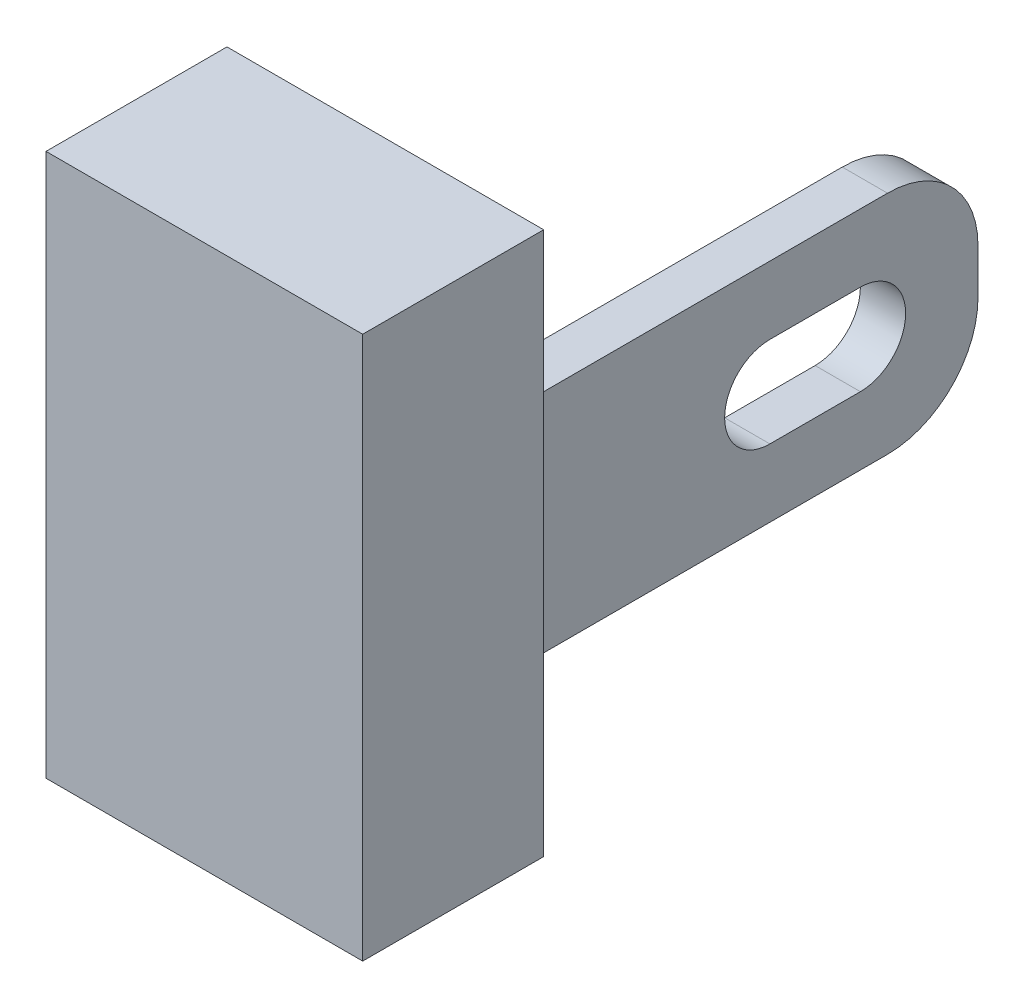
ISO-10303-21;
HEADER;
FILE_DESCRIPTION(('STEP AP214'),'2;1');
FILE_NAME('part.step','',(''),(''),'','','');
FILE_SCHEMA(('AUTOMOTIVE_DESIGN { 1 0 10303 214 1 1 1 1 }'));
ENDSEC;
DATA;
#1=APPLICATION_CONTEXT('core data for automotive mechanical design processes');
#2=APPLICATION_PROTOCOL_DEFINITION('international standard','automotive_design',2000,#1);
#3=PRODUCT_CONTEXT('',#1,'mechanical');
#4=PRODUCT('Part','Part','',(#3));
#5=PRODUCT_RELATED_PRODUCT_CATEGORY('part','',(#4));
#6=PRODUCT_DEFINITION_FORMATION('','',#4);
#7=PRODUCT_DEFINITION_CONTEXT('part definition',#1,'design');
#8=PRODUCT_DEFINITION('design','',#6,#7);
#9=PRODUCT_DEFINITION_SHAPE('','',#8);
#10=(LENGTH_UNIT() NAMED_UNIT(*) SI_UNIT(.MILLI.,.METRE.));
#11=(NAMED_UNIT(*) PLANE_ANGLE_UNIT() SI_UNIT($,.RADIAN.));
#12=(NAMED_UNIT(*) SI_UNIT($,.STERADIAN.) SOLID_ANGLE_UNIT());
#13=UNCERTAINTY_MEASURE_WITH_UNIT(LENGTH_MEASURE(1.E-05),#10,'distance_accuracy_value','');
#14=(GEOMETRIC_REPRESENTATION_CONTEXT(3) GLOBAL_UNCERTAINTY_ASSIGNED_CONTEXT((#13)) GLOBAL_UNIT_ASSIGNED_CONTEXT((#10,
#11,#12)) REPRESENTATION_CONTEXT('',''));
#15=CARTESIAN_POINT('',(0.,0.,0.));
#16=DIRECTION('',(0.,0.,1.));
#17=DIRECTION('',(1.,0.,0.));
#18=AXIS2_PLACEMENT_3D('',#15,#16,#17);
#19=CARTESIAN_POINT('',(0.,0.,0.));
#20=DIRECTION('',(0.,0.,1.));
#21=DIRECTION('',(1.,0.,0.));
#22=AXIS2_PLACEMENT_3D('',#19,#20,#21);
#23=PLANE('',#22);
#24=DIRECTION('',(0.,-1.,0.));
#25=VECTOR('',#24,1.);
#26=CARTESIAN_POINT('',(-1.75,-3.,0.));
#27=LINE('',#26,#25);
#28=CARTESIAN_POINT('',(-1.75,3.,0.));
#29=VERTEX_POINT('',#28);
#30=CARTESIAN_POINT('',(-1.75,-3.,0.));
#31=VERTEX_POINT('',#30);
#32=EDGE_CURVE('E206',#29,#31,#27,.T.);
#33=ORIENTED_EDGE('',*,*,#32,.F.);
#34=DIRECTION('',(-1.,0.,0.));
#35=VECTOR('',#34,1.);
#36=CARTESIAN_POINT('',(1.75,3.,0.));
#37=LINE('',#36,#35);
#38=CARTESIAN_POINT('',(1.75,3.,0.));
#39=VERTEX_POINT('',#38);
#40=EDGE_CURVE('E211',#39,#29,#37,.T.);
#41=ORIENTED_EDGE('',*,*,#40,.F.);
#42=DIRECTION('',(0.,1.,0.));
#43=VECTOR('',#42,1.);
#44=CARTESIAN_POINT('',(1.75,-3.,0.));
#45=LINE('',#44,#43);
#46=CARTESIAN_POINT('',(1.75,-3.,0.));
#47=VERTEX_POINT('',#46);
#48=EDGE_CURVE('E222',#47,#39,#45,.T.);
#49=ORIENTED_EDGE('',*,*,#48,.F.);
#50=DIRECTION('',(1.,0.,0.));
#51=VECTOR('',#50,1.);
#52=CARTESIAN_POINT('',(1.75,-3.,0.));
#53=LINE('',#52,#51);
#54=EDGE_CURVE('E220',#31,#47,#53,.T.);
#55=ORIENTED_EDGE('',*,*,#54,.F.);
#56=EDGE_LOOP('',(#33,#41,#49,#55));
#57=FACE_BOUND('',#56,.T.);
#58=DIRECTION('',(0.,1.,0.));
#59=VECTOR('',#58,1.);
#60=CARTESIAN_POINT('',(1.05,-1.25,0.));
#61=LINE('',#60,#59);
#62=CARTESIAN_POINT('',(1.05,-1.25,0.));
#63=VERTEX_POINT('',#62);
#64=CARTESIAN_POINT('',(1.05,1.25,0.));
#65=VERTEX_POINT('',#64);
#66=EDGE_CURVE('E180',#63,#65,#61,.T.);
#67=ORIENTED_EDGE('',*,*,#66,.F.);
#68=DIRECTION('',(-1.,0.,0.));
#69=VECTOR('',#68,1.);
#70=CARTESIAN_POINT('',(1.55,-1.25,0.));
#71=LINE('',#70,#69);
#72=CARTESIAN_POINT('',(1.55,-1.25,0.));
#73=VERTEX_POINT('',#72);
#74=EDGE_CURVE('E185',#73,#63,#71,.T.);
#75=ORIENTED_EDGE('',*,*,#74,.F.);
#76=DIRECTION('',(0.,-1.,0.));
#77=VECTOR('',#76,1.);
#78=CARTESIAN_POINT('',(1.55,-1.25,0.));
#79=LINE('',#78,#77);
#80=CARTESIAN_POINT('',(1.55,1.25,0.));
#81=VERTEX_POINT('',#80);
#82=EDGE_CURVE('E194',#81,#73,#79,.T.);
#83=ORIENTED_EDGE('',*,*,#82,.F.);
#84=DIRECTION('',(1.,0.,0.));
#85=VECTOR('',#84,1.);
#86=CARTESIAN_POINT('',(1.55,1.25,0.));
#87=LINE('',#86,#85);
#88=EDGE_CURVE('E191',#65,#81,#87,.T.);
#89=ORIENTED_EDGE('',*,*,#88,.F.);
#90=EDGE_LOOP('',(#67,#75,#83,#89));
#91=FACE_BOUND('',#90,.T.);
#92=ADVANCED_FACE('F43',(#57,#91),#23,.F.);
#93=CARTESIAN_POINT('',(-1.75,-3.,2.));
#94=DIRECTION('',(1.,0.,0.));
#95=DIRECTION('',(0.,0.,-1.));
#96=AXIS2_PLACEMENT_3D('',#93,#94,#95);
#97=PLANE('',#96);
#98=ORIENTED_EDGE('',*,*,#32,.T.);
#99=DIRECTION('',(0.,0.,-1.));
#100=VECTOR('',#99,1.);
#101=CARTESIAN_POINT('',(-1.75,-3.,2.));
#102=LINE('',#101,#100);
#103=CARTESIAN_POINT('',(-1.75,-3.,2.));
#104=VERTEX_POINT('',#103);
#105=EDGE_CURVE('E233',#104,#31,#102,.T.);
#106=ORIENTED_EDGE('',*,*,#105,.F.);
#107=DIRECTION('',(0.,-1.,0.));
#108=VECTOR('',#107,1.);
#109=CARTESIAN_POINT('',(-1.75,-3.,2.));
#110=LINE('',#109,#108);
#111=CARTESIAN_POINT('',(-1.75,3.,2.));
#112=VERTEX_POINT('',#111);
#113=EDGE_CURVE('E207',#112,#104,#110,.T.);
#114=ORIENTED_EDGE('',*,*,#113,.F.);
#115=DIRECTION('',(0.,0.,-1.));
#116=VECTOR('',#115,1.);
#117=CARTESIAN_POINT('',(-1.75,3.,2.));
#118=LINE('',#117,#116);
#119=EDGE_CURVE('E217',#112,#29,#118,.T.);
#120=ORIENTED_EDGE('',*,*,#119,.T.);
#121=EDGE_LOOP('',(#98,#106,#114,#120));
#122=FACE_BOUND('',#121,.T.);
#123=ADVANCED_FACE('F287',(#122),#97,.F.);
#124=CARTESIAN_POINT('',(1.75,-3.,2.));
#125=DIRECTION('',(0.,1.,0.));
#126=DIRECTION('',(0.,0.,1.));
#127=AXIS2_PLACEMENT_3D('',#124,#125,#126);
#128=PLANE('',#127);
#129=ORIENTED_EDGE('',*,*,#54,.T.);
#130=DIRECTION('',(0.,0.,-1.));
#131=VECTOR('',#130,1.);
#132=CARTESIAN_POINT('',(1.75,-3.,2.));
#133=LINE('',#132,#131);
#134=CARTESIAN_POINT('',(1.75,-3.,2.));
#135=VERTEX_POINT('',#134);
#136=EDGE_CURVE('E230',#135,#47,#133,.T.);
#137=ORIENTED_EDGE('',*,*,#136,.F.);
#138=DIRECTION('',(1.,0.,0.));
#139=VECTOR('',#138,1.);
#140=CARTESIAN_POINT('',(1.75,-3.,2.));
#141=LINE('',#140,#139);
#142=EDGE_CURVE('E210',#104,#135,#141,.T.);
#143=ORIENTED_EDGE('',*,*,#142,.F.);
#144=ORIENTED_EDGE('',*,*,#105,.T.);
#145=EDGE_LOOP('',(#129,#137,#143,#144));
#146=FACE_BOUND('',#145,.T.);
#147=ADVANCED_FACE('F293',(#146),#128,.F.);
#148=CARTESIAN_POINT('',(1.75,-3.,2.));
#149=DIRECTION('',(-1.,0.,0.));
#150=DIRECTION('',(0.,0.,1.));
#151=AXIS2_PLACEMENT_3D('',#148,#149,#150);
#152=PLANE('',#151);
#153=ORIENTED_EDGE('',*,*,#48,.T.);
#154=DIRECTION('',(0.,0.,-1.));
#155=VECTOR('',#154,1.);
#156=CARTESIAN_POINT('',(1.75,3.,2.));
#157=LINE('',#156,#155);
#158=CARTESIAN_POINT('',(1.75,3.,2.));
#159=VERTEX_POINT('',#158);
#160=EDGE_CURVE('E227',#159,#39,#157,.T.);
#161=ORIENTED_EDGE('',*,*,#160,.F.);
#162=DIRECTION('',(0.,1.,0.));
#163=VECTOR('',#162,1.);
#164=CARTESIAN_POINT('',(1.75,-3.,2.));
#165=LINE('',#164,#163);
#166=EDGE_CURVE('E213',#135,#159,#165,.T.);
#167=ORIENTED_EDGE('',*,*,#166,.F.);
#168=ORIENTED_EDGE('',*,*,#136,.T.);
#169=EDGE_LOOP('',(#153,#161,#167,#168));
#170=FACE_BOUND('',#169,.T.);
#171=ADVANCED_FACE('F304',(#170),#152,.F.);
#172=CARTESIAN_POINT('',(1.75,3.,2.));
#173=DIRECTION('',(0.,-1.,0.));
#174=DIRECTION('',(0.,0.,-1.));
#175=AXIS2_PLACEMENT_3D('',#172,#173,#174);
#176=PLANE('',#175);
#177=ORIENTED_EDGE('',*,*,#40,.T.);
#178=ORIENTED_EDGE('',*,*,#119,.F.);
#179=DIRECTION('',(-1.,0.,0.));
#180=VECTOR('',#179,1.);
#181=CARTESIAN_POINT('',(1.75,3.,2.));
#182=LINE('',#181,#180);
#183=EDGE_CURVE('E215',#159,#112,#182,.T.);
#184=ORIENTED_EDGE('',*,*,#183,.F.);
#185=ORIENTED_EDGE('',*,*,#160,.T.);
#186=EDGE_LOOP('',(#177,#178,#184,#185));
#187=FACE_BOUND('',#186,.T.);
#188=ADVANCED_FACE('F301',(#187),#176,.F.);
#189=CARTESIAN_POINT('',(0.,0.,2.));
#190=DIRECTION('',(0.,0.,1.));
#191=DIRECTION('',(1.,0.,0.));
#192=AXIS2_PLACEMENT_3D('',#189,#190,#191);
#193=PLANE('',#192);
#194=ORIENTED_EDGE('',*,*,#113,.T.);
#195=ORIENTED_EDGE('',*,*,#142,.T.);
#196=ORIENTED_EDGE('',*,*,#166,.T.);
#197=ORIENTED_EDGE('',*,*,#183,.T.);
#198=EDGE_LOOP('',(#194,#195,#196,#197));
#199=FACE_BOUND('',#198,.T.);
#200=ADVANCED_FACE('F299',(#199),#193,.T.);
#201=CARTESIAN_POINT('',(1.05,-1.25,-5.));
#202=DIRECTION('',(1.,0.,0.));
#203=DIRECTION('',(0.,0.,-1.));
#204=AXIS2_PLACEMENT_3D('',#201,#202,#203);
#205=PLANE('',#204);
#206=DIRECTION('',(0.,0.,1.));
#207=VECTOR('',#206,1.);
#208=CARTESIAN_POINT('',(1.05,0.5,-5.));
#209=LINE('',#208,#207);
#210=CARTESIAN_POINT('',(1.05,0.5,-3.7));
#211=VERTEX_POINT('',#210);
#212=CARTESIAN_POINT('',(1.05,0.5,-2.7));
#213=VERTEX_POINT('',#212);
#214=EDGE_CURVE('E174',#211,#213,#209,.T.);
#215=ORIENTED_EDGE('',*,*,#214,.T.);
#216=CARTESIAN_POINT('',(1.05,0.,-2.7));
#217=DIRECTION('',(1.,0.,0.));
#218=DIRECTION('',(0.,0.,-1.));
#219=AXIS2_PLACEMENT_3D('',#216,#217,#218);
#220=CIRCLE('',#219,0.5);
#221=CARTESIAN_POINT('',(1.05,-0.5,-2.7));
#222=VERTEX_POINT('',#221);
#223=EDGE_CURVE('E177',#213,#222,#220,.T.);
#224=ORIENTED_EDGE('',*,*,#223,.T.);
#225=DIRECTION('',(0.,0.,-1.));
#226=VECTOR('',#225,1.);
#227=CARTESIAN_POINT('',(1.05,-0.5,-5.));
#228=LINE('',#227,#226);
#229=CARTESIAN_POINT('',(1.05,-0.5,-3.7));
#230=VERTEX_POINT('',#229);
#231=EDGE_CURVE('E169',#222,#230,#228,.T.);
#232=ORIENTED_EDGE('',*,*,#231,.T.);
#233=CARTESIAN_POINT('',(1.05,0.,-3.7));
#234=DIRECTION('',(1.,0.,0.));
#235=DIRECTION('',(0.,0.,-1.));
#236=AXIS2_PLACEMENT_3D('',#233,#234,#235);
#237=CIRCLE('',#236,0.5);
#238=EDGE_CURVE('E149',#230,#211,#237,.T.);
#239=ORIENTED_EDGE('',*,*,#238,.T.);
#240=EDGE_LOOP('',(#215,#224,#232,#239));
#241=FACE_BOUND('',#240,.T.);
#242=DIRECTION('',(0.,1.,0.));
#243=VECTOR('',#242,1.);
#244=CARTESIAN_POINT('',(1.05,-1.25,-5.));
#245=LINE('',#244,#243);
#246=CARTESIAN_POINT('',(1.05,-0.25,-5.));
#247=VERTEX_POINT('',#246);
#248=CARTESIAN_POINT('',(1.05,0.25,-5.));
#249=VERTEX_POINT('',#248);
#250=EDGE_CURVE('E181',#247,#249,#245,.T.);
#251=ORIENTED_EDGE('',*,*,#250,.F.);
#252=CARTESIAN_POINT('',(1.05,-0.25,-4.));
#253=DIRECTION('',(1.,0.,0.));
#254=DIRECTION('',(0.,0.,-1.));
#255=AXIS2_PLACEMENT_3D('',#252,#253,#254);
#256=CIRCLE('',#255,1.);
#257=CARTESIAN_POINT('',(1.05,-1.25,-4.));
#258=VERTEX_POINT('',#257);
#259=EDGE_CURVE('E244',#247,#258,#256,.F.);
#260=ORIENTED_EDGE('',*,*,#259,.T.);
#261=DIRECTION('',(0.,0.,1.));
#262=VECTOR('',#261,1.);
#263=CARTESIAN_POINT('',(1.05,-1.25,-5.));
#264=LINE('',#263,#262);
#265=EDGE_CURVE('E188',#258,#63,#264,.T.);
#266=ORIENTED_EDGE('',*,*,#265,.T.);
#267=ORIENTED_EDGE('',*,*,#66,.T.);
#268=DIRECTION('',(0.,0.,1.));
#269=VECTOR('',#268,1.);
#270=CARTESIAN_POINT('',(1.05,1.25,-5.));
#271=LINE('',#270,#269);
#272=CARTESIAN_POINT('',(1.05,1.25,-4.));
#273=VERTEX_POINT('',#272);
#274=EDGE_CURVE('E204',#273,#65,#271,.T.);
#275=ORIENTED_EDGE('',*,*,#274,.F.);
#276=CARTESIAN_POINT('',(1.05,0.25,-4.));
#277=DIRECTION('',(1.,0.,0.));
#278=DIRECTION('',(0.,0.,-1.));
#279=AXIS2_PLACEMENT_3D('',#276,#277,#278);
#280=CIRCLE('',#279,1.);
#281=EDGE_CURVE('E242',#273,#249,#280,.F.);
#282=ORIENTED_EDGE('',*,*,#281,.T.);
#283=EDGE_LOOP('',(#251,#260,#266,#267,#275,#282));
#284=FACE_BOUND('',#283,.T.);
#285=ADVANCED_FACE('F262',(#241,#284),#205,.F.);
#286=CARTESIAN_POINT('',(1.55,1.25,-5.));
#287=DIRECTION('',(0.,-1.,0.));
#288=DIRECTION('',(0.,0.,-1.));
#289=AXIS2_PLACEMENT_3D('',#286,#287,#288);
#290=PLANE('',#289);
#291=DIRECTION('',(0.,0.,1.));
#292=VECTOR('',#291,1.);
#293=CARTESIAN_POINT('',(1.55,1.25,-5.));
#294=LINE('',#293,#292);
#295=CARTESIAN_POINT('',(1.55,1.25,-4.));
#296=VERTEX_POINT('',#295);
#297=EDGE_CURVE('E202',#296,#81,#294,.T.);
#298=ORIENTED_EDGE('',*,*,#297,.F.);
#299=DIRECTION('',(1.,0.,0.));
#300=VECTOR('',#299,1.);
#301=CARTESIAN_POINT('',(1.55,1.25,-4.));
#302=LINE('',#301,#300);
#303=EDGE_CURVE('E11',#296,#273,#302,.F.);
#304=ORIENTED_EDGE('',*,*,#303,.T.);
#305=ORIENTED_EDGE('',*,*,#274,.T.);
#306=ORIENTED_EDGE('',*,*,#88,.T.);
#307=EDGE_LOOP('',(#298,#304,#305,#306));
#308=FACE_BOUND('',#307,.T.);
#309=ADVANCED_FACE('F273',(#308),#290,.F.);
#310=CARTESIAN_POINT('',(1.55,-1.25,-5.));
#311=DIRECTION('',(-1.,0.,0.));
#312=DIRECTION('',(0.,0.,1.));
#313=AXIS2_PLACEMENT_3D('',#310,#311,#312);
#314=PLANE('',#313);
#315=DIRECTION('',(0.,0.,-1.));
#316=VECTOR('',#315,1.);
#317=CARTESIAN_POINT('',(1.55,-0.5,-2.7));
#318=LINE('',#317,#316);
#319=CARTESIAN_POINT('',(1.55,-0.5,-2.7));
#320=VERTEX_POINT('',#319);
#321=CARTESIAN_POINT('',(1.55,-0.5,-3.7));
#322=VERTEX_POINT('',#321);
#323=EDGE_CURVE('E155',#320,#322,#318,.T.);
#324=ORIENTED_EDGE('',*,*,#323,.F.);
#325=CARTESIAN_POINT('',(1.55,0.,-2.7));
#326=DIRECTION('',(1.,0.,0.));
#327=DIRECTION('',(0.,0.,-1.));
#328=AXIS2_PLACEMENT_3D('',#325,#326,#327);
#329=CIRCLE('',#328,0.5);
#330=CARTESIAN_POINT('',(1.55,0.5,-2.7));
#331=VERTEX_POINT('',#330);
#332=EDGE_CURVE('E66',#331,#320,#329,.T.);
#333=ORIENTED_EDGE('',*,*,#332,.F.);
#334=DIRECTION('',(0.,0.,1.));
#335=VECTOR('',#334,1.);
#336=CARTESIAN_POINT('',(1.55,0.5,-2.7));
#337=LINE('',#336,#335);
#338=CARTESIAN_POINT('',(1.55,0.5,-3.7));
#339=VERTEX_POINT('',#338);
#340=EDGE_CURVE('E162',#339,#331,#337,.T.);
#341=ORIENTED_EDGE('',*,*,#340,.F.);
#342=CARTESIAN_POINT('',(1.55,0.,-3.7));
#343=DIRECTION('',(1.,0.,0.));
#344=DIRECTION('',(0.,0.,-1.));
#345=AXIS2_PLACEMENT_3D('',#342,#343,#344);
#346=CIRCLE('',#345,0.5);
#347=EDGE_CURVE('E146',#322,#339,#346,.T.);
#348=ORIENTED_EDGE('',*,*,#347,.F.);
#349=EDGE_LOOP('',(#324,#333,#341,#348));
#350=FACE_BOUND('',#349,.T.);
#351=DIRECTION('',(0.,0.,1.));
#352=VECTOR('',#351,1.);
#353=CARTESIAN_POINT('',(1.55,-1.25,-5.));
#354=LINE('',#353,#352);
#355=CARTESIAN_POINT('',(1.55,-1.25,-4.));
#356=VERTEX_POINT('',#355);
#357=EDGE_CURVE('E200',#356,#73,#354,.T.);
#358=ORIENTED_EDGE('',*,*,#357,.F.);
#359=CARTESIAN_POINT('',(1.55,-0.25,-4.));
#360=DIRECTION('',(-1.,0.,0.));
#361=DIRECTION('',(0.,0.,1.));
#362=AXIS2_PLACEMENT_3D('',#359,#360,#361);
#363=CIRCLE('',#362,1.);
#364=CARTESIAN_POINT('',(1.55,-0.25,-5.));
#365=VERTEX_POINT('',#364);
#366=EDGE_CURVE('E51',#356,#365,#363,.F.);
#367=ORIENTED_EDGE('',*,*,#366,.T.);
#368=DIRECTION('',(0.,-1.,0.));
#369=VECTOR('',#368,1.);
#370=CARTESIAN_POINT('',(1.55,-1.25,-5.));
#371=LINE('',#370,#369);
#372=CARTESIAN_POINT('',(1.55,0.25,-5.));
#373=VERTEX_POINT('',#372);
#374=EDGE_CURVE('E184',#373,#365,#371,.T.);
#375=ORIENTED_EDGE('',*,*,#374,.F.);
#376=CARTESIAN_POINT('',(1.55,0.25,-4.));
#377=DIRECTION('',(-1.,0.,0.));
#378=DIRECTION('',(0.,0.,1.));
#379=AXIS2_PLACEMENT_3D('',#376,#377,#378);
#380=CIRCLE('',#379,1.);
#381=EDGE_CURVE('E248',#373,#296,#380,.F.);
#382=ORIENTED_EDGE('',*,*,#381,.T.);
#383=ORIENTED_EDGE('',*,*,#297,.T.);
#384=ORIENTED_EDGE('',*,*,#82,.T.);
#385=EDGE_LOOP('',(#358,#367,#375,#382,#383,#384));
#386=FACE_BOUND('',#385,.T.);
#387=ADVANCED_FACE('F159',(#350,#386),#314,.F.);
#388=CARTESIAN_POINT('',(1.55,-1.25,-5.));
#389=DIRECTION('',(0.,1.,0.));
#390=DIRECTION('',(0.,0.,1.));
#391=AXIS2_PLACEMENT_3D('',#388,#389,#390);
#392=PLANE('',#391);
#393=ORIENTED_EDGE('',*,*,#265,.F.);
#394=DIRECTION('',(-1.,0.,0.));
#395=VECTOR('',#394,1.);
#396=CARTESIAN_POINT('',(1.55,-1.25,-4.));
#397=LINE('',#396,#395);
#398=EDGE_CURVE('E246',#258,#356,#397,.F.);
#399=ORIENTED_EDGE('',*,*,#398,.T.);
#400=ORIENTED_EDGE('',*,*,#357,.T.);
#401=ORIENTED_EDGE('',*,*,#74,.T.);
#402=EDGE_LOOP('',(#393,#399,#400,#401));
#403=FACE_BOUND('',#402,.T.);
#404=ADVANCED_FACE('F265',(#403),#392,.F.);
#405=CARTESIAN_POINT('',(0.,0.,-5.));
#406=DIRECTION('',(0.,0.,1.));
#407=DIRECTION('',(1.,0.,0.));
#408=AXIS2_PLACEMENT_3D('',#405,#406,#407);
#409=PLANE('',#408);
#410=ORIENTED_EDGE('',*,*,#374,.T.);
#411=DIRECTION('',(-1.,0.,0.));
#412=VECTOR('',#411,1.);
#413=CARTESIAN_POINT('',(0.,-0.25,-5.));
#414=LINE('',#413,#412);
#415=EDGE_CURVE('E239',#365,#247,#414,.T.);
#416=ORIENTED_EDGE('',*,*,#415,.T.);
#417=ORIENTED_EDGE('',*,*,#250,.T.);
#418=DIRECTION('',(1.,0.,0.));
#419=VECTOR('',#418,1.);
#420=CARTESIAN_POINT('',(0.,0.25,-5.));
#421=LINE('',#420,#419);
#422=EDGE_CURVE('E236',#249,#373,#421,.T.);
#423=ORIENTED_EDGE('',*,*,#422,.T.);
#424=EDGE_LOOP('',(#410,#416,#417,#423));
#425=FACE_BOUND('',#424,.T.);
#426=ADVANCED_FACE('F256',(#425),#409,.F.);
#427=CARTESIAN_POINT('',(0.,-0.25,-4.));
#428=DIRECTION('',(-1.,0.,0.));
#429=DIRECTION('',(0.,0.,1.));
#430=AXIS2_PLACEMENT_3D('',#427,#428,#429);
#431=CYLINDRICAL_SURFACE('',#430,1.);
#432=ORIENTED_EDGE('',*,*,#366,.F.);
#433=ORIENTED_EDGE('',*,*,#398,.F.);
#434=ORIENTED_EDGE('',*,*,#259,.F.);
#435=ORIENTED_EDGE('',*,*,#415,.F.);
#436=EDGE_LOOP('',(#432,#433,#434,#435));
#437=FACE_BOUND('',#436,.T.);
#438=ADVANCED_FACE('F259',(#437),#431,.T.);
#439=CARTESIAN_POINT('',(0.,0.25,-4.));
#440=DIRECTION('',(1.,0.,0.));
#441=DIRECTION('',(0.,0.,-1.));
#442=AXIS2_PLACEMENT_3D('',#439,#440,#441);
#443=CYLINDRICAL_SURFACE('',#442,1.);
#444=ORIENTED_EDGE('',*,*,#281,.F.);
#445=ORIENTED_EDGE('',*,*,#303,.F.);
#446=ORIENTED_EDGE('',*,*,#381,.F.);
#447=ORIENTED_EDGE('',*,*,#422,.F.);
#448=EDGE_LOOP('',(#444,#445,#446,#447));
#449=FACE_BOUND('',#448,.T.);
#450=ADVANCED_FACE('F45',(#449),#443,.T.);
#451=CARTESIAN_POINT('',(-3.45,0.,-2.7));
#452=DIRECTION('',(1.,0.,0.));
#453=DIRECTION('',(0.,0.,-1.));
#454=AXIS2_PLACEMENT_3D('',#451,#452,#453);
#455=CYLINDRICAL_SURFACE('',#454,0.5);
#456=DIRECTION('',(1.,0.,0.));
#457=VECTOR('',#456,1.);
#458=CARTESIAN_POINT('',(-3.45,0.5,-2.7));
#459=LINE('',#458,#457);
#460=EDGE_CURVE('E167',#213,#331,#459,.T.);
#461=ORIENTED_EDGE('',*,*,#460,.T.);
#462=ORIENTED_EDGE('',*,*,#332,.T.);
#463=DIRECTION('',(1.,0.,0.));
#464=VECTOR('',#463,1.);
#465=CARTESIAN_POINT('',(-3.45,-0.5,-2.7));
#466=LINE('',#465,#464);
#467=EDGE_CURVE('E152',#222,#320,#466,.T.);
#468=ORIENTED_EDGE('',*,*,#467,.F.);
#469=ORIENTED_EDGE('',*,*,#223,.F.);
#470=EDGE_LOOP('',(#461,#462,#468,#469));
#471=FACE_BOUND('',#470,.T.);
#472=ADVANCED_FACE('F278',(#471),#455,.F.);
#473=CARTESIAN_POINT('',(-3.45,0.5,-2.7));
#474=DIRECTION('',(0.,1.,0.));
#475=DIRECTION('',(0.,0.,1.));
#476=AXIS2_PLACEMENT_3D('',#473,#474,#475);
#477=PLANE('',#476);
#478=DIRECTION('',(1.,0.,0.));
#479=VECTOR('',#478,1.);
#480=CARTESIAN_POINT('',(-3.45,0.5,-3.7));
#481=LINE('',#480,#479);
#482=EDGE_CURVE('E151',#211,#339,#481,.T.);
#483=ORIENTED_EDGE('',*,*,#482,.T.);
#484=ORIENTED_EDGE('',*,*,#340,.T.);
#485=ORIENTED_EDGE('',*,*,#460,.F.);
#486=ORIENTED_EDGE('',*,*,#214,.F.);
#487=EDGE_LOOP('',(#483,#484,#485,#486));
#488=FACE_BOUND('',#487,.T.);
#489=ADVANCED_FACE('F284',(#488),#477,.F.);
#490=CARTESIAN_POINT('',(-3.45,0.,-3.7));
#491=DIRECTION('',(1.,0.,0.));
#492=DIRECTION('',(0.,0.,-1.));
#493=AXIS2_PLACEMENT_3D('',#490,#491,#492);
#494=CYLINDRICAL_SURFACE('',#493,0.5);
#495=DIRECTION('',(1.,0.,0.));
#496=VECTOR('',#495,1.);
#497=CARTESIAN_POINT('',(-3.45,-0.5,-3.7));
#498=LINE('',#497,#496);
#499=EDGE_CURVE('E58',#230,#322,#498,.T.);
#500=ORIENTED_EDGE('',*,*,#499,.T.);
#501=ORIENTED_EDGE('',*,*,#347,.T.);
#502=ORIENTED_EDGE('',*,*,#482,.F.);
#503=ORIENTED_EDGE('',*,*,#238,.F.);
#504=EDGE_LOOP('',(#500,#501,#502,#503));
#505=FACE_BOUND('',#504,.T.);
#506=ADVANCED_FACE('F143',(#505),#494,.F.);
#507=CARTESIAN_POINT('',(-3.45,-0.5,-2.7));
#508=DIRECTION('',(0.,-1.,0.));
#509=DIRECTION('',(0.,0.,-1.));
#510=AXIS2_PLACEMENT_3D('',#507,#508,#509);
#511=PLANE('',#510);
#512=ORIENTED_EDGE('',*,*,#467,.T.);
#513=ORIENTED_EDGE('',*,*,#323,.T.);
#514=ORIENTED_EDGE('',*,*,#499,.F.);
#515=ORIENTED_EDGE('',*,*,#231,.F.);
#516=EDGE_LOOP('',(#512,#513,#514,#515));
#517=FACE_BOUND('',#516,.T.);
#518=ADVANCED_FACE('F156',(#517),#511,.F.);
#519=CLOSED_SHELL('',(#92,#123,#147,#171,#188,#200,#285,#309,#387,#404,#426,#438,#450,#472,#489,
#506,#518));
#520=MANIFOLD_SOLID_BREP('B2',#519);
#521=ADVANCED_BREP_SHAPE_REPRESENTATION('',(#18,#520),#14);
#522=SHAPE_DEFINITION_REPRESENTATION(#9,#521);
ENDSEC;
END-ISO-10303-21;
